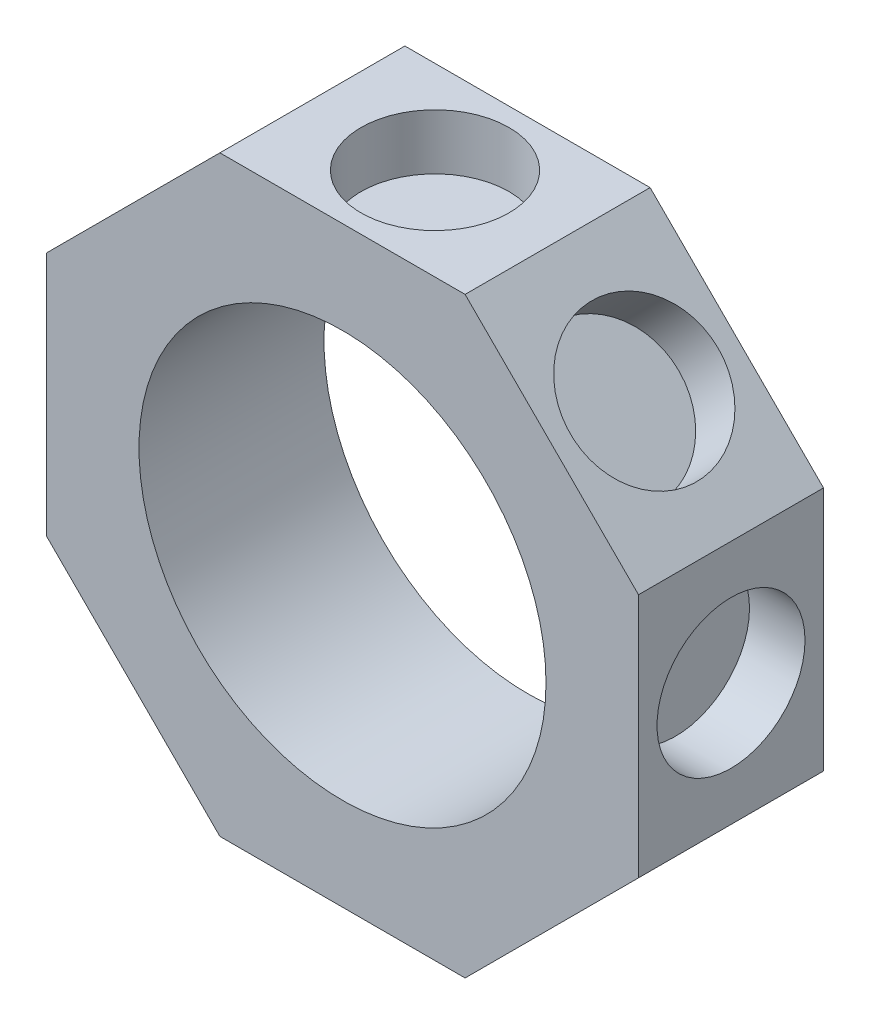
ISO-10303-21;
HEADER;
FILE_DESCRIPTION(('STEP AP214'),'2;1');
FILE_NAME('part.step','',(''),(''),'','','');
FILE_SCHEMA(('AUTOMOTIVE_DESIGN { 1 0 10303 214 1 1 1 1 }'));
ENDSEC;
DATA;
#1=APPLICATION_CONTEXT('core data for automotive mechanical design processes');
#2=APPLICATION_PROTOCOL_DEFINITION('international standard','automotive_design',2000,#1);
#3=PRODUCT_CONTEXT('',#1,'mechanical');
#4=PRODUCT('Part','Part','',(#3));
#5=PRODUCT_RELATED_PRODUCT_CATEGORY('part','',(#4));
#6=PRODUCT_DEFINITION_FORMATION('','',#4);
#7=PRODUCT_DEFINITION_CONTEXT('part definition',#1,'design');
#8=PRODUCT_DEFINITION('design','',#6,#7);
#9=PRODUCT_DEFINITION_SHAPE('','',#8);
#10=(LENGTH_UNIT() NAMED_UNIT(*) SI_UNIT(.MILLI.,.METRE.));
#11=(NAMED_UNIT(*) PLANE_ANGLE_UNIT() SI_UNIT($,.RADIAN.));
#12=(NAMED_UNIT(*) SI_UNIT($,.STERADIAN.) SOLID_ANGLE_UNIT());
#13=UNCERTAINTY_MEASURE_WITH_UNIT(LENGTH_MEASURE(1.E-05),#10,'distance_accuracy_value','');
#14=(GEOMETRIC_REPRESENTATION_CONTEXT(3) GLOBAL_UNCERTAINTY_ASSIGNED_CONTEXT((#13)) GLOBAL_UNIT_ASSIGNED_CONTEXT((#10,
#11,#12)) REPRESENTATION_CONTEXT('',''));
#15=CARTESIAN_POINT('',(0.,0.,0.));
#16=DIRECTION('',(0.,0.,1.));
#17=DIRECTION('',(1.,0.,0.));
#18=AXIS2_PLACEMENT_3D('',#15,#16,#17);
#19=CARTESIAN_POINT('',(0.,0.,5.));
#20=DIRECTION('',(0.,0.,1.));
#21=DIRECTION('',(1.,0.,0.));
#22=AXIS2_PLACEMENT_3D('',#19,#20,#21);
#23=PLANE('',#22);
#24=DIRECTION('',(-0.707106781186548,-0.707106781186547,0.));
#25=VECTOR('',#24,1.);
#26=CARTESIAN_POINT('',(-6.62741699796952,16.,5.));
#27=LINE('',#26,#25);
#28=CARTESIAN_POINT('',(-6.62741699796952,16.,5.));
#29=VERTEX_POINT('',#28);
#30=CARTESIAN_POINT('',(-16.,6.62741699796953,5.));
#31=VERTEX_POINT('',#30);
#32=EDGE_CURVE('E170',#29,#31,#27,.T.);
#33=ORIENTED_EDGE('',*,*,#32,.T.);
#34=DIRECTION('',(0.,-1.,0.));
#35=VECTOR('',#34,1.);
#36=CARTESIAN_POINT('',(-16.,6.62741699796953,5.));
#37=LINE('',#36,#35);
#38=CARTESIAN_POINT('',(-16.,-6.62741699796953,5.));
#39=VERTEX_POINT('',#38);
#40=EDGE_CURVE('E106',#31,#39,#37,.T.);
#41=ORIENTED_EDGE('',*,*,#40,.T.);
#42=DIRECTION('',(0.707106781186548,-0.707106781186547,0.));
#43=VECTOR('',#42,1.);
#44=CARTESIAN_POINT('',(-16.,-6.62741699796953,5.));
#45=LINE('',#44,#43);
#46=CARTESIAN_POINT('',(-6.6274169979695,-16.,5.));
#47=VERTEX_POINT('',#46);
#48=EDGE_CURVE('E191',#39,#47,#45,.T.);
#49=ORIENTED_EDGE('',*,*,#48,.T.);
#50=DIRECTION('',(1.,0.,0.));
#51=VECTOR('',#50,1.);
#52=CARTESIAN_POINT('',(-6.6274169979695,-16.,5.));
#53=LINE('',#52,#51);
#54=CARTESIAN_POINT('',(6.62741699796952,-16.,5.));
#55=VERTEX_POINT('',#54);
#56=EDGE_CURVE('E205',#47,#55,#53,.T.);
#57=ORIENTED_EDGE('',*,*,#56,.T.);
#58=DIRECTION('',(0.707106781186547,0.707106781186548,0.));
#59=VECTOR('',#58,1.);
#60=CARTESIAN_POINT('',(6.62741699796952,-16.,5.));
#61=LINE('',#60,#59);
#62=CARTESIAN_POINT('',(16.,-6.62741699796952,5.));
#63=VERTEX_POINT('',#62);
#64=EDGE_CURVE('E125',#55,#63,#61,.T.);
#65=ORIENTED_EDGE('',*,*,#64,.T.);
#66=DIRECTION('',(0.,1.,0.));
#67=VECTOR('',#66,1.);
#68=CARTESIAN_POINT('',(16.,-6.62741699796952,5.));
#69=LINE('',#68,#67);
#70=CARTESIAN_POINT('',(16.,6.62741699796952,5.));
#71=VERTEX_POINT('',#70);
#72=EDGE_CURVE('E119',#63,#71,#69,.T.);
#73=ORIENTED_EDGE('',*,*,#72,.T.);
#74=DIRECTION('',(-0.707106781186547,0.707106781186548,0.));
#75=VECTOR('',#74,1.);
#76=CARTESIAN_POINT('',(16.,6.62741699796952,5.));
#77=LINE('',#76,#75);
#78=CARTESIAN_POINT('',(6.62741699796953,16.,5.));
#79=VERTEX_POINT('',#78);
#80=EDGE_CURVE('E123',#71,#79,#77,.T.);
#81=ORIENTED_EDGE('',*,*,#80,.T.);
#82=DIRECTION('',(-1.,0.,0.));
#83=VECTOR('',#82,1.);
#84=CARTESIAN_POINT('',(6.62741699796953,16.,5.));
#85=LINE('',#84,#83);
#86=EDGE_CURVE('E63',#79,#29,#85,.T.);
#87=ORIENTED_EDGE('',*,*,#86,.T.);
#88=EDGE_LOOP('',(#33,#41,#49,#57,#65,#73,#81,#87));
#89=FACE_BOUND('',#88,.T.);
#90=CARTESIAN_POINT('',(0.,0.,5.));
#91=DIRECTION('',(0.,0.,1.));
#92=DIRECTION('',(1.,0.,0.));
#93=AXIS2_PLACEMENT_3D('',#90,#91,#92);
#94=CIRCLE('',#93,11.);
#95=CARTESIAN_POINT('',(11.,0.,5.));
#96=VERTEX_POINT('',#95);
#97=EDGE_CURVE('E152',#96,#96,#94,.T.);
#98=ORIENTED_EDGE('',*,*,#97,.F.);
#99=EDGE_LOOP('',(#98));
#100=FACE_BOUND('',#99,.T.);
#101=ADVANCED_FACE('F45',(#89,#100),#23,.T.);
#102=CARTESIAN_POINT('',(0.,0.,-5.));
#103=DIRECTION('',(0.,0.,1.));
#104=DIRECTION('',(1.,0.,0.));
#105=AXIS2_PLACEMENT_3D('',#102,#103,#104);
#106=PLANE('',#105);
#107=DIRECTION('',(-0.707106781186548,-0.707106781186547,0.));
#108=VECTOR('',#107,1.);
#109=CARTESIAN_POINT('',(-6.62741699796952,16.,-5.));
#110=LINE('',#109,#108);
#111=CARTESIAN_POINT('',(-6.62741699796952,16.,-5.));
#112=VERTEX_POINT('',#111);
#113=CARTESIAN_POINT('',(-16.,6.62741699796953,-5.));
#114=VERTEX_POINT('',#113);
#115=EDGE_CURVE('E147',#112,#114,#110,.T.);
#116=ORIENTED_EDGE('',*,*,#115,.F.);
#117=DIRECTION('',(-1.,0.,0.));
#118=VECTOR('',#117,1.);
#119=CARTESIAN_POINT('',(6.62741699796953,16.,-5.));
#120=LINE('',#119,#118);
#121=CARTESIAN_POINT('',(6.62741699796953,16.,-5.));
#122=VERTEX_POINT('',#121);
#123=EDGE_CURVE('E98',#122,#112,#120,.T.);
#124=ORIENTED_EDGE('',*,*,#123,.F.);
#125=DIRECTION('',(-0.707106781186547,0.707106781186548,0.));
#126=VECTOR('',#125,1.);
#127=CARTESIAN_POINT('',(16.,6.62741699796952,-5.));
#128=LINE('',#127,#126);
#129=CARTESIAN_POINT('',(16.,6.62741699796952,-5.));
#130=VERTEX_POINT('',#129);
#131=EDGE_CURVE('E92',#130,#122,#128,.T.);
#132=ORIENTED_EDGE('',*,*,#131,.F.);
#133=DIRECTION('',(0.,1.,0.));
#134=VECTOR('',#133,1.);
#135=CARTESIAN_POINT('',(16.,-6.62741699796952,-5.));
#136=LINE('',#135,#134);
#137=CARTESIAN_POINT('',(16.,-6.62741699796952,-5.));
#138=VERTEX_POINT('',#137);
#139=EDGE_CURVE('E134',#138,#130,#136,.T.);
#140=ORIENTED_EDGE('',*,*,#139,.F.);
#141=DIRECTION('',(0.707106781186547,0.707106781186548,0.));
#142=VECTOR('',#141,1.);
#143=CARTESIAN_POINT('',(6.62741699796952,-16.,-5.));
#144=LINE('',#143,#142);
#145=CARTESIAN_POINT('',(6.62741699796952,-16.,-5.));
#146=VERTEX_POINT('',#145);
#147=EDGE_CURVE('E161',#146,#138,#144,.T.);
#148=ORIENTED_EDGE('',*,*,#147,.F.);
#149=DIRECTION('',(1.,0.,0.));
#150=VECTOR('',#149,1.);
#151=CARTESIAN_POINT('',(-6.6274169979695,-16.,-5.));
#152=LINE('',#151,#150);
#153=CARTESIAN_POINT('',(-6.6274169979695,-16.,-5.));
#154=VERTEX_POINT('',#153);
#155=EDGE_CURVE('E158',#154,#146,#152,.T.);
#156=ORIENTED_EDGE('',*,*,#155,.F.);
#157=DIRECTION('',(0.707106781186548,-0.707106781186547,0.));
#158=VECTOR('',#157,1.);
#159=CARTESIAN_POINT('',(-16.,-6.62741699796953,-5.));
#160=LINE('',#159,#158);
#161=CARTESIAN_POINT('',(-16.,-6.62741699796953,-5.));
#162=VERTEX_POINT('',#161);
#163=EDGE_CURVE('E155',#162,#154,#160,.T.);
#164=ORIENTED_EDGE('',*,*,#163,.F.);
#165=DIRECTION('',(0.,-1.,0.));
#166=VECTOR('',#165,1.);
#167=CARTESIAN_POINT('',(-16.,6.62741699796953,-5.));
#168=LINE('',#167,#166);
#169=EDGE_CURVE('E151',#114,#162,#168,.T.);
#170=ORIENTED_EDGE('',*,*,#169,.F.);
#171=EDGE_LOOP('',(#116,#124,#132,#140,#148,#156,#164,#170));
#172=FACE_BOUND('',#171,.T.);
#173=CARTESIAN_POINT('',(0.,0.,-5.));
#174=DIRECTION('',(0.,0.,1.));
#175=DIRECTION('',(1.,0.,0.));
#176=AXIS2_PLACEMENT_3D('',#173,#174,#175);
#177=CIRCLE('',#176,11.);
#178=CARTESIAN_POINT('',(11.,0.,-5.));
#179=VERTEX_POINT('',#178);
#180=EDGE_CURVE('E215',#179,#179,#177,.T.);
#181=ORIENTED_EDGE('',*,*,#180,.T.);
#182=EDGE_LOOP('',(#181));
#183=FACE_BOUND('',#182,.T.);
#184=ADVANCED_FACE('F195',(#172,#183),#106,.F.);
#185=CARTESIAN_POINT('',(-6.62741699796952,16.,5.));
#186=DIRECTION('',(0.707106781186547,-0.707106781186548,0.));
#187=DIRECTION('',(0.707106781186548,0.707106781186547,0.));
#188=AXIS2_PLACEMENT_3D('',#185,#186,#187);
#189=PLANE('',#188);
#190=CARTESIAN_POINT('',(-11.3137084989849,11.3137084989847,0.));
#191=DIRECTION('',(-0.707106781186554,0.707106781186541,0.));
#192=DIRECTION('',(0.,0.,-1.));
#193=AXIS2_PLACEMENT_3D('',#190,#191,#192);
#194=CIRCLE('',#193,4.);
#195=CARTESIAN_POINT('',(-11.3137084989849,11.3137084989847,-4.));
#196=VERTEX_POINT('',#195);
#197=EDGE_CURVE('E239',#196,#196,#194,.T.);
#198=ORIENTED_EDGE('',*,*,#197,.F.);
#199=EDGE_LOOP('',(#198));
#200=FACE_BOUND('',#199,.T.);
#201=ORIENTED_EDGE('',*,*,#115,.T.);
#202=DIRECTION('',(0.,0.,-1.));
#203=VECTOR('',#202,1.);
#204=CARTESIAN_POINT('',(-16.,6.62741699796953,5.));
#205=LINE('',#204,#203);
#206=EDGE_CURVE('E11',#31,#114,#205,.T.);
#207=ORIENTED_EDGE('',*,*,#206,.F.);
#208=ORIENTED_EDGE('',*,*,#32,.F.);
#209=DIRECTION('',(0.,0.,-1.));
#210=VECTOR('',#209,1.);
#211=CARTESIAN_POINT('',(-6.62741699796952,16.,5.));
#212=LINE('',#211,#210);
#213=EDGE_CURVE('E143',#29,#112,#212,.T.);
#214=ORIENTED_EDGE('',*,*,#213,.T.);
#215=EDGE_LOOP('',(#201,#207,#208,#214));
#216=FACE_BOUND('',#215,.T.);
#217=ADVANCED_FACE('F47',(#200,#216),#189,.F.);
#218=CARTESIAN_POINT('',(-16.,6.62741699796953,5.));
#219=DIRECTION('',(1.,0.,0.));
#220=DIRECTION('',(0.,0.,-1.));
#221=AXIS2_PLACEMENT_3D('',#218,#219,#220);
#222=PLANE('',#221);
#223=CARTESIAN_POINT('',(-16.,-1.6759110426447E-13,0.));
#224=DIRECTION('',(-1.,0.,0.));
#225=DIRECTION('',(0.,0.,-1.));
#226=AXIS2_PLACEMENT_3D('',#223,#224,#225);
#227=CIRCLE('',#226,4.);
#228=CARTESIAN_POINT('',(-16.,-1.6759110426447E-13,-4.));
#229=VERTEX_POINT('',#228);
#230=EDGE_CURVE('E279',#229,#229,#227,.T.);
#231=ORIENTED_EDGE('',*,*,#230,.F.);
#232=EDGE_LOOP('',(#231));
#233=FACE_BOUND('',#232,.T.);
#234=ORIENTED_EDGE('',*,*,#169,.T.);
#235=DIRECTION('',(0.,0.,-1.));
#236=VECTOR('',#235,1.);
#237=CARTESIAN_POINT('',(-16.,-6.62741699796953,5.));
#238=LINE('',#237,#236);
#239=EDGE_CURVE('E55',#39,#162,#238,.T.);
#240=ORIENTED_EDGE('',*,*,#239,.F.);
#241=ORIENTED_EDGE('',*,*,#40,.F.);
#242=ORIENTED_EDGE('',*,*,#206,.T.);
#243=EDGE_LOOP('',(#234,#240,#241,#242));
#244=FACE_BOUND('',#243,.T.);
#245=ADVANCED_FACE('F296',(#233,#244),#222,.F.);
#246=CARTESIAN_POINT('',(-16.,-6.62741699796953,5.));
#247=DIRECTION('',(0.707106781186547,0.707106781186548,0.));
#248=DIRECTION('',(-0.707106781186548,0.707106781186547,0.));
#249=AXIS2_PLACEMENT_3D('',#246,#247,#248);
#250=PLANE('',#249);
#251=CARTESIAN_POINT('',(-11.3137084989846,-11.3137084989849,0.));
#252=DIRECTION('',(-0.707106781186539,-0.707106781186556,0.));
#253=DIRECTION('',(0.,0.,-1.));
#254=AXIS2_PLACEMENT_3D('',#251,#252,#253);
#255=CIRCLE('',#254,4.);
#256=CARTESIAN_POINT('',(-11.3137084989846,-11.3137084989849,-4.));
#257=VERTEX_POINT('',#256);
#258=EDGE_CURVE('E271',#257,#257,#255,.T.);
#259=ORIENTED_EDGE('',*,*,#258,.F.);
#260=EDGE_LOOP('',(#259));
#261=FACE_BOUND('',#260,.T.);
#262=ORIENTED_EDGE('',*,*,#163,.T.);
#263=DIRECTION('',(0.,0.,-1.));
#264=VECTOR('',#263,1.);
#265=CARTESIAN_POINT('',(-6.6274169979695,-16.,5.));
#266=LINE('',#265,#264);
#267=EDGE_CURVE('E181',#47,#154,#266,.T.);
#268=ORIENTED_EDGE('',*,*,#267,.F.);
#269=ORIENTED_EDGE('',*,*,#48,.F.);
#270=ORIENTED_EDGE('',*,*,#239,.T.);
#271=EDGE_LOOP('',(#262,#268,#269,#270));
#272=FACE_BOUND('',#271,.T.);
#273=ADVANCED_FACE('F189',(#261,#272),#250,.F.);
#274=CARTESIAN_POINT('',(-6.6274169979695,-16.,5.));
#275=DIRECTION('',(0.,1.,0.));
#276=DIRECTION('',(0.,0.,1.));
#277=AXIS2_PLACEMENT_3D('',#274,#275,#276);
#278=PLANE('',#277);
#279=CARTESIAN_POINT('',(0.,-16.,0.));
#280=DIRECTION('',(0.,-1.,0.));
#281=DIRECTION('',(0.,0.,-1.));
#282=AXIS2_PLACEMENT_3D('',#279,#280,#281);
#283=CIRCLE('',#282,4.);
#284=CARTESIAN_POINT('',(0.,-16.,-4.));
#285=VERTEX_POINT('',#284);
#286=EDGE_CURVE('E223',#285,#285,#283,.T.);
#287=ORIENTED_EDGE('',*,*,#286,.F.);
#288=EDGE_LOOP('',(#287));
#289=FACE_BOUND('',#288,.T.);
#290=ORIENTED_EDGE('',*,*,#155,.T.);
#291=DIRECTION('',(0.,0.,-1.));
#292=VECTOR('',#291,1.);
#293=CARTESIAN_POINT('',(6.62741699796952,-16.,5.));
#294=LINE('',#293,#292);
#295=EDGE_CURVE('E177',#55,#146,#294,.T.);
#296=ORIENTED_EDGE('',*,*,#295,.F.);
#297=ORIENTED_EDGE('',*,*,#56,.F.);
#298=ORIENTED_EDGE('',*,*,#267,.T.);
#299=EDGE_LOOP('',(#290,#296,#297,#298));
#300=FACE_BOUND('',#299,.T.);
#301=ADVANCED_FACE('F200',(#289,#300),#278,.F.);
#302=CARTESIAN_POINT('',(6.62741699796952,-16.,5.));
#303=DIRECTION('',(-0.707106781186548,0.707106781186547,0.));
#304=DIRECTION('',(-0.707106781186547,-0.707106781186548,0.));
#305=AXIS2_PLACEMENT_3D('',#302,#303,#304);
#306=PLANE('',#305);
#307=CARTESIAN_POINT('',(11.3137084989848,-11.3137084989847,0.));
#308=DIRECTION('',(0.707106781186549,-0.707106781186546,0.));
#309=DIRECTION('',(0.,0.,-1.));
#310=AXIS2_PLACEMENT_3D('',#307,#308,#309);
#311=CIRCLE('',#310,4.);
#312=CARTESIAN_POINT('',(11.3137084989848,-11.3137084989847,-4.));
#313=VERTEX_POINT('',#312);
#314=EDGE_CURVE('E231',#313,#313,#311,.T.);
#315=ORIENTED_EDGE('',*,*,#314,.F.);
#316=EDGE_LOOP('',(#315));
#317=FACE_BOUND('',#316,.T.);
#318=ORIENTED_EDGE('',*,*,#147,.T.);
#319=DIRECTION('',(0.,0.,-1.));
#320=VECTOR('',#319,1.);
#321=CARTESIAN_POINT('',(16.,-6.62741699796952,5.));
#322=LINE('',#321,#320);
#323=EDGE_CURVE('E136',#63,#138,#322,.T.);
#324=ORIENTED_EDGE('',*,*,#323,.F.);
#325=ORIENTED_EDGE('',*,*,#64,.F.);
#326=ORIENTED_EDGE('',*,*,#295,.T.);
#327=EDGE_LOOP('',(#318,#324,#325,#326));
#328=FACE_BOUND('',#327,.T.);
#329=ADVANCED_FACE('F203',(#317,#328),#306,.F.);
#330=CARTESIAN_POINT('',(16.,-6.62741699796952,5.));
#331=DIRECTION('',(-1.,0.,0.));
#332=DIRECTION('',(0.,-1.,0.));
#333=AXIS2_PLACEMENT_3D('',#330,#331,#332);
#334=PLANE('',#333);
#335=CARTESIAN_POINT('',(16.,0.,0.));
#336=DIRECTION('',(1.,0.,0.));
#337=DIRECTION('',(0.,0.,-1.));
#338=AXIS2_PLACEMENT_3D('',#335,#336,#337);
#339=CIRCLE('',#338,4.);
#340=CARTESIAN_POINT('',(16.,0.,-4.));
#341=VERTEX_POINT('',#340);
#342=EDGE_CURVE('E264',#341,#341,#339,.T.);
#343=ORIENTED_EDGE('',*,*,#342,.F.);
#344=EDGE_LOOP('',(#343));
#345=FACE_BOUND('',#344,.T.);
#346=ORIENTED_EDGE('',*,*,#139,.T.);
#347=DIRECTION('',(0.,0.,-1.));
#348=VECTOR('',#347,1.);
#349=CARTESIAN_POINT('',(16.,6.62741699796952,5.));
#350=LINE('',#349,#348);
#351=EDGE_CURVE('E131',#71,#130,#350,.T.);
#352=ORIENTED_EDGE('',*,*,#351,.F.);
#353=ORIENTED_EDGE('',*,*,#72,.F.);
#354=ORIENTED_EDGE('',*,*,#323,.T.);
#355=EDGE_LOOP('',(#346,#352,#353,#354));
#356=FACE_BOUND('',#355,.T.);
#357=ADVANCED_FACE('F132',(#345,#356),#334,.F.);
#358=CARTESIAN_POINT('',(16.,6.62741699796952,5.));
#359=DIRECTION('',(-0.707106781186548,-0.707106781186547,0.));
#360=DIRECTION('',(0.707106781186547,-0.707106781186548,0.));
#361=AXIS2_PLACEMENT_3D('',#358,#359,#360);
#362=PLANE('',#361);
#363=CARTESIAN_POINT('',(11.3137084989847,11.3137084989848,0.));
#364=DIRECTION('',(0.707106781186544,0.707106781186551,0.));
#365=DIRECTION('',(0.,0.,-1.));
#366=AXIS2_PLACEMENT_3D('',#363,#364,#365);
#367=CIRCLE('',#366,4.);
#368=CARTESIAN_POINT('',(11.3137084989847,11.3137084989848,-4.));
#369=VERTEX_POINT('',#368);
#370=EDGE_CURVE('E256',#369,#369,#367,.T.);
#371=ORIENTED_EDGE('',*,*,#370,.F.);
#372=EDGE_LOOP('',(#371));
#373=FACE_BOUND('',#372,.T.);
#374=ORIENTED_EDGE('',*,*,#131,.T.);
#375=DIRECTION('',(0.,0.,-1.));
#376=VECTOR('',#375,1.);
#377=CARTESIAN_POINT('',(6.62741699796953,16.,5.));
#378=LINE('',#377,#376);
#379=EDGE_CURVE('E137',#79,#122,#378,.T.);
#380=ORIENTED_EDGE('',*,*,#379,.F.);
#381=ORIENTED_EDGE('',*,*,#80,.F.);
#382=ORIENTED_EDGE('',*,*,#351,.T.);
#383=EDGE_LOOP('',(#374,#380,#381,#382));
#384=FACE_BOUND('',#383,.T.);
#385=ADVANCED_FACE('F139',(#373,#384),#362,.F.);
#386=CARTESIAN_POINT('',(6.62741699796953,16.,5.));
#387=DIRECTION('',(0.,-1.,0.));
#388=DIRECTION('',(1.,0.,0.));
#389=AXIS2_PLACEMENT_3D('',#386,#387,#388);
#390=PLANE('',#389);
#391=CARTESIAN_POINT('',(0.,16.,0.));
#392=DIRECTION('',(0.,1.,0.));
#393=DIRECTION('',(0.,0.,-1.));
#394=AXIS2_PLACEMENT_3D('',#391,#392,#393);
#395=CIRCLE('',#394,4.);
#396=CARTESIAN_POINT('',(0.,16.,-4.));
#397=VERTEX_POINT('',#396);
#398=EDGE_CURVE('E248',#397,#397,#395,.T.);
#399=ORIENTED_EDGE('',*,*,#398,.F.);
#400=EDGE_LOOP('',(#399));
#401=FACE_BOUND('',#400,.T.);
#402=ORIENTED_EDGE('',*,*,#123,.T.);
#403=ORIENTED_EDGE('',*,*,#213,.F.);
#404=ORIENTED_EDGE('',*,*,#86,.F.);
#405=ORIENTED_EDGE('',*,*,#379,.T.);
#406=EDGE_LOOP('',(#402,#403,#404,#405));
#407=FACE_BOUND('',#406,.T.);
#408=ADVANCED_FACE('F301',(#401,#407),#390,.F.);
#409=CARTESIAN_POINT('',(0.,0.,5.));
#410=DIRECTION('',(0.,0.,-1.));
#411=DIRECTION('',(-1.,0.,0.));
#412=AXIS2_PLACEMENT_3D('',#409,#410,#411);
#413=CYLINDRICAL_SURFACE('',#412,11.);
#414=ORIENTED_EDGE('',*,*,#97,.T.);
#415=EDGE_LOOP('',(#414));
#416=FACE_BOUND('',#415,.T.);
#417=ORIENTED_EDGE('',*,*,#180,.F.);
#418=EDGE_LOOP('',(#417));
#419=FACE_BOUND('',#418,.T.);
#420=ADVANCED_FACE('F303',(#416,#419),#413,.F.);
#421=CARTESIAN_POINT('',(0.,-13.,0.));
#422=DIRECTION('',(0.,-1.,0.));
#423=DIRECTION('',(0.,0.,-1.));
#424=AXIS2_PLACEMENT_3D('',#421,#422,#423);
#425=CYLINDRICAL_SURFACE('',#424,4.);
#426=CARTESIAN_POINT('',(0.,-13.,0.));
#427=DIRECTION('',(0.,-1.,0.));
#428=DIRECTION('',(0.,0.,-1.));
#429=AXIS2_PLACEMENT_3D('',#426,#427,#428);
#430=CIRCLE('',#429,4.);
#431=CARTESIAN_POINT('',(0.,-13.,-4.));
#432=VERTEX_POINT('',#431);
#433=EDGE_CURVE('E219',#432,#432,#430,.T.);
#434=ORIENTED_EDGE('',*,*,#433,.F.);
#435=EDGE_LOOP('',(#434));
#436=FACE_BOUND('',#435,.T.);
#437=ORIENTED_EDGE('',*,*,#286,.T.);
#438=EDGE_LOOP('',(#437));
#439=FACE_BOUND('',#438,.T.);
#440=ADVANCED_FACE('F311',(#436,#439),#425,.F.);
#441=CARTESIAN_POINT('',(0.,-13.,0.));
#442=DIRECTION('',(0.,-1.,0.));
#443=DIRECTION('',(0.,0.,-1.));
#444=AXIS2_PLACEMENT_3D('',#441,#442,#443);
#445=PLANE('',#444);
#446=ORIENTED_EDGE('',*,*,#433,.T.);
#447=EDGE_LOOP('',(#446));
#448=FACE_BOUND('',#447,.T.);
#449=ADVANCED_FACE('F326',(#448),#445,.T.);
#450=CARTESIAN_POINT('',(0.,13.,0.));
#451=DIRECTION('',(0.,1.,0.));
#452=DIRECTION('',(0.,0.,1.));
#453=AXIS2_PLACEMENT_3D('',#450,#451,#452);
#454=CYLINDRICAL_SURFACE('',#453,4.);
#455=CARTESIAN_POINT('',(0.,13.,0.));
#456=DIRECTION('',(0.,1.,0.));
#457=DIRECTION('',(0.,0.,-1.));
#458=AXIS2_PLACEMENT_3D('',#455,#456,#457);
#459=CIRCLE('',#458,4.);
#460=CARTESIAN_POINT('',(0.,13.,-4.));
#461=VERTEX_POINT('',#460);
#462=EDGE_CURVE('E252',#461,#461,#459,.T.);
#463=ORIENTED_EDGE('',*,*,#462,.F.);
#464=EDGE_LOOP('',(#463));
#465=FACE_BOUND('',#464,.T.);
#466=ORIENTED_EDGE('',*,*,#398,.T.);
#467=EDGE_LOOP('',(#466));
#468=FACE_BOUND('',#467,.T.);
#469=ADVANCED_FACE('F330',(#465,#468),#454,.F.);
#470=CARTESIAN_POINT('',(0.,13.,0.));
#471=DIRECTION('',(0.,1.,0.));
#472=DIRECTION('',(0.,0.,-1.));
#473=AXIS2_PLACEMENT_3D('',#470,#471,#472);
#474=PLANE('',#473);
#475=ORIENTED_EDGE('',*,*,#462,.T.);
#476=EDGE_LOOP('',(#475));
#477=FACE_BOUND('',#476,.T.);
#478=ADVANCED_FACE('F351',(#477),#474,.T.);
#479=CARTESIAN_POINT('',(9.19238815542507,9.19238815542517,0.));
#480=DIRECTION('',(0.707106781186544,0.707106781186551,0.));
#481=DIRECTION('',(-0.707106781186551,0.707106781186544,0.));
#482=AXIS2_PLACEMENT_3D('',#479,#480,#481);
#483=CYLINDRICAL_SURFACE('',#482,4.);
#484=CARTESIAN_POINT('',(9.19238815542507,9.19238815542517,0.));
#485=DIRECTION('',(0.707106781186544,0.707106781186551,0.));
#486=DIRECTION('',(0.,0.,-1.));
#487=AXIS2_PLACEMENT_3D('',#484,#485,#486);
#488=CIRCLE('',#487,4.);
#489=CARTESIAN_POINT('',(9.19238815542507,9.19238815542517,-4.));
#490=VERTEX_POINT('',#489);
#491=EDGE_CURVE('E260',#490,#490,#488,.T.);
#492=ORIENTED_EDGE('',*,*,#491,.F.);
#493=EDGE_LOOP('',(#492));
#494=FACE_BOUND('',#493,.T.);
#495=ORIENTED_EDGE('',*,*,#370,.T.);
#496=EDGE_LOOP('',(#495));
#497=FACE_BOUND('',#496,.T.);
#498=ADVANCED_FACE('F355',(#494,#497),#483,.F.);
#499=CARTESIAN_POINT('',(9.19238815542507,9.19238815542517,0.));
#500=DIRECTION('',(0.707106781186544,0.707106781186551,0.));
#501=DIRECTION('',(0.,0.,-1.));
#502=AXIS2_PLACEMENT_3D('',#499,#500,#501);
#503=PLANE('',#502);
#504=ORIENTED_EDGE('',*,*,#491,.T.);
#505=EDGE_LOOP('',(#504));
#506=FACE_BOUND('',#505,.T.);
#507=ADVANCED_FACE('F359',(#506),#503,.T.);
#508=CARTESIAN_POINT('',(13.,0.,0.));
#509=DIRECTION('',(1.,0.,0.));
#510=DIRECTION('',(0.,1.,0.));
#511=AXIS2_PLACEMENT_3D('',#508,#509,#510);
#512=CYLINDRICAL_SURFACE('',#511,4.);
#513=CARTESIAN_POINT('',(13.,0.,0.));
#514=DIRECTION('',(1.,0.,0.));
#515=DIRECTION('',(0.,0.,-1.));
#516=AXIS2_PLACEMENT_3D('',#513,#514,#515);
#517=CIRCLE('',#516,4.);
#518=CARTESIAN_POINT('',(13.,0.,-4.));
#519=VERTEX_POINT('',#518);
#520=EDGE_CURVE('E235',#519,#519,#517,.T.);
#521=ORIENTED_EDGE('',*,*,#520,.F.);
#522=EDGE_LOOP('',(#521));
#523=FACE_BOUND('',#522,.T.);
#524=ORIENTED_EDGE('',*,*,#342,.T.);
#525=EDGE_LOOP('',(#524));
#526=FACE_BOUND('',#525,.T.);
#527=ADVANCED_FACE('F363',(#523,#526),#512,.F.);
#528=CARTESIAN_POINT('',(13.,0.,0.));
#529=DIRECTION('',(1.,0.,0.));
#530=DIRECTION('',(0.,0.,-1.));
#531=AXIS2_PLACEMENT_3D('',#528,#529,#530);
#532=PLANE('',#531);
#533=ORIENTED_EDGE('',*,*,#520,.T.);
#534=EDGE_LOOP('',(#533));
#535=FACE_BOUND('',#534,.T.);
#536=ADVANCED_FACE('F336',(#535),#532,.T.);
#537=CARTESIAN_POINT('',(9.19238815542514,-9.19238815542511,0.));
#538=DIRECTION('',(0.707106781186549,-0.707106781186546,0.));
#539=DIRECTION('',(0.707106781186546,0.707106781186549,0.));
#540=AXIS2_PLACEMENT_3D('',#537,#538,#539);
#541=CYLINDRICAL_SURFACE('',#540,4.);
#542=CARTESIAN_POINT('',(9.19238815542514,-9.19238815542511,0.));
#543=DIRECTION('',(0.707106781186549,-0.707106781186546,0.));
#544=DIRECTION('',(0.,0.,-1.));
#545=AXIS2_PLACEMENT_3D('',#542,#543,#544);
#546=CIRCLE('',#545,4.);
#547=CARTESIAN_POINT('',(9.19238815542514,-9.19238815542511,-4.));
#548=VERTEX_POINT('',#547);
#549=EDGE_CURVE('E227',#548,#548,#546,.T.);
#550=ORIENTED_EDGE('',*,*,#549,.F.);
#551=EDGE_LOOP('',(#550));
#552=FACE_BOUND('',#551,.T.);
#553=ORIENTED_EDGE('',*,*,#314,.T.);
#554=EDGE_LOOP('',(#553));
#555=FACE_BOUND('',#554,.T.);
#556=ADVANCED_FACE('F332',(#552,#555),#541,.F.);
#557=CARTESIAN_POINT('',(9.19238815542514,-9.19238815542511,0.));
#558=DIRECTION('',(0.707106781186549,-0.707106781186546,0.));
#559=DIRECTION('',(0.,0.,-1.));
#560=AXIS2_PLACEMENT_3D('',#557,#558,#559);
#561=PLANE('',#560);
#562=ORIENTED_EDGE('',*,*,#549,.T.);
#563=EDGE_LOOP('',(#562));
#564=FACE_BOUND('',#563,.T.);
#565=ADVANCED_FACE('F335',(#564),#561,.T.);
#566=CARTESIAN_POINT('',(-9.19238815542501,-9.19238815542523,0.));
#567=DIRECTION('',(-0.707106781186539,-0.707106781186556,0.));
#568=DIRECTION('',(0.707106781186556,-0.707106781186539,0.));
#569=AXIS2_PLACEMENT_3D('',#566,#567,#568);
#570=CYLINDRICAL_SURFACE('',#569,4.);
#571=CARTESIAN_POINT('',(-9.19238815542501,-9.19238815542523,0.));
#572=DIRECTION('',(-0.707106781186539,-0.707106781186556,0.));
#573=DIRECTION('',(0.,0.,-1.));
#574=AXIS2_PLACEMENT_3D('',#571,#572,#573);
#575=CIRCLE('',#574,4.);
#576=CARTESIAN_POINT('',(-9.19238815542501,-9.19238815542523,-4.));
#577=VERTEX_POINT('',#576);
#578=EDGE_CURVE('E275',#577,#577,#575,.T.);
#579=ORIENTED_EDGE('',*,*,#578,.F.);
#580=EDGE_LOOP('',(#579));
#581=FACE_BOUND('',#580,.T.);
#582=ORIENTED_EDGE('',*,*,#258,.T.);
#583=EDGE_LOOP('',(#582));
#584=FACE_BOUND('',#583,.T.);
#585=ADVANCED_FACE('F340',(#581,#584),#570,.F.);
#586=CARTESIAN_POINT('',(-9.19238815542501,-9.19238815542523,0.));
#587=DIRECTION('',(-0.707106781186539,-0.707106781186556,0.));
#588=DIRECTION('',(0.,0.,-1.));
#589=AXIS2_PLACEMENT_3D('',#586,#587,#588);
#590=PLANE('',#589);
#591=ORIENTED_EDGE('',*,*,#578,.T.);
#592=EDGE_LOOP('',(#591));
#593=FACE_BOUND('',#592,.T.);
#594=ADVANCED_FACE('F292',(#593),#590,.T.);
#595=CARTESIAN_POINT('',(-13.,-1.36167772214882E-13,0.));
#596=DIRECTION('',(-1.,0.,0.));
#597=DIRECTION('',(0.,-1.,0.));
#598=AXIS2_PLACEMENT_3D('',#595,#596,#597);
#599=CYLINDRICAL_SURFACE('',#598,4.);
#600=CARTESIAN_POINT('',(-13.,-1.36167772214882E-13,0.));
#601=DIRECTION('',(-1.,0.,0.));
#602=DIRECTION('',(0.,0.,-1.));
#603=AXIS2_PLACEMENT_3D('',#600,#601,#602);
#604=CIRCLE('',#603,4.);
#605=CARTESIAN_POINT('',(-13.,-1.36167772214882E-13,-4.));
#606=VERTEX_POINT('',#605);
#607=EDGE_CURVE('E244',#606,#606,#604,.T.);
#608=ORIENTED_EDGE('',*,*,#607,.F.);
#609=EDGE_LOOP('',(#608));
#610=FACE_BOUND('',#609,.T.);
#611=ORIENTED_EDGE('',*,*,#230,.T.);
#612=EDGE_LOOP('',(#611));
#613=FACE_BOUND('',#612,.T.);
#614=ADVANCED_FACE('F289',(#610,#613),#599,.F.);
#615=CARTESIAN_POINT('',(-13.,-1.36167772214882E-13,0.));
#616=DIRECTION('',(-1.,0.,0.));
#617=DIRECTION('',(0.,0.,-1.));
#618=AXIS2_PLACEMENT_3D('',#615,#616,#617);
#619=PLANE('',#618);
#620=ORIENTED_EDGE('',*,*,#607,.T.);
#621=EDGE_LOOP('',(#620));
#622=FACE_BOUND('',#621,.T.);
#623=ADVANCED_FACE('F287',(#622),#619,.T.);
#624=CARTESIAN_POINT('',(-9.1923881554252,9.19238815542504,0.));
#625=DIRECTION('',(-0.707106781186554,0.707106781186541,0.));
#626=DIRECTION('',(-0.707106781186541,-0.707106781186554,0.));
#627=AXIS2_PLACEMENT_3D('',#624,#625,#626);
#628=CYLINDRICAL_SURFACE('',#627,4.);
#629=CARTESIAN_POINT('',(-9.1923881554252,9.19238815542504,0.));
#630=DIRECTION('',(-0.707106781186554,0.707106781186541,0.));
#631=DIRECTION('',(0.,0.,-1.));
#632=AXIS2_PLACEMENT_3D('',#629,#630,#631);
#633=CIRCLE('',#632,4.);
#634=CARTESIAN_POINT('',(-9.1923881554252,9.19238815542504,-4.));
#635=VERTEX_POINT('',#634);
#636=EDGE_CURVE('E243',#635,#635,#633,.T.);
#637=ORIENTED_EDGE('',*,*,#636,.F.);
#638=EDGE_LOOP('',(#637));
#639=FACE_BOUND('',#638,.T.);
#640=ORIENTED_EDGE('',*,*,#197,.T.);
#641=EDGE_LOOP('',(#640));
#642=FACE_BOUND('',#641,.T.);
#643=ADVANCED_FACE('F342',(#639,#642),#628,.F.);
#644=CARTESIAN_POINT('',(-9.1923881554252,9.19238815542504,0.));
#645=DIRECTION('',(-0.707106781186554,0.707106781186541,0.));
#646=DIRECTION('',(0.,0.,-1.));
#647=AXIS2_PLACEMENT_3D('',#644,#645,#646);
#648=PLANE('',#647);
#649=ORIENTED_EDGE('',*,*,#636,.T.);
#650=EDGE_LOOP('',(#649));
#651=FACE_BOUND('',#650,.T.);
#652=ADVANCED_FACE('F345',(#651),#648,.T.);
#653=CLOSED_SHELL('',(#101,#184,#217,#245,#273,#301,#329,#357,#385,#408,#420,#440,#449,#469,
#478,#498,#507,#527,#536,#556,#565,#585,#594,#614,#623,#643,#652));
#654=MANIFOLD_SOLID_BREP('B2',#653);
#655=ADVANCED_BREP_SHAPE_REPRESENTATION('',(#18,#654),#14);
#656=SHAPE_DEFINITION_REPRESENTATION(#9,#655);
ENDSEC;
END-ISO-10303-21;
